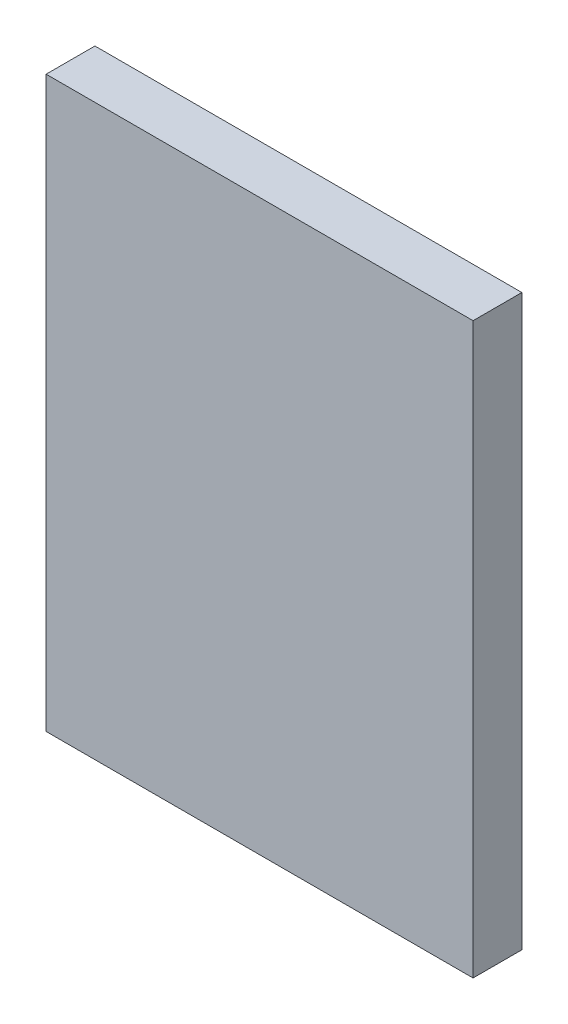
ISO-10303-21;
HEADER;
FILE_DESCRIPTION(('STEP AP214'),'2;1');
FILE_NAME('part.step','',(''),(''),'','','');
FILE_SCHEMA(('AUTOMOTIVE_DESIGN { 1 0 10303 214 1 1 1 1 }'));
ENDSEC;
DATA;
#1=APPLICATION_CONTEXT('core data for automotive mechanical design processes');
#2=APPLICATION_PROTOCOL_DEFINITION('international standard','automotive_design',2000,#1);
#3=PRODUCT_CONTEXT('',#1,'mechanical');
#4=PRODUCT('Part','Part','',(#3));
#5=PRODUCT_RELATED_PRODUCT_CATEGORY('part','',(#4));
#6=PRODUCT_DEFINITION_FORMATION('','',#4);
#7=PRODUCT_DEFINITION_CONTEXT('part definition',#1,'design');
#8=PRODUCT_DEFINITION('design','',#6,#7);
#9=PRODUCT_DEFINITION_SHAPE('','',#8);
#10=(LENGTH_UNIT() NAMED_UNIT(*) SI_UNIT(.MILLI.,.METRE.));
#11=(NAMED_UNIT(*) PLANE_ANGLE_UNIT() SI_UNIT($,.RADIAN.));
#12=(NAMED_UNIT(*) SI_UNIT($,.STERADIAN.) SOLID_ANGLE_UNIT());
#13=UNCERTAINTY_MEASURE_WITH_UNIT(LENGTH_MEASURE(1.E-05),#10,'distance_accuracy_value','');
#14=(GEOMETRIC_REPRESENTATION_CONTEXT(3) GLOBAL_UNCERTAINTY_ASSIGNED_CONTEXT((#13)) GLOBAL_UNIT_ASSIGNED_CONTEXT((#10,
#11,#12)) REPRESENTATION_CONTEXT('',''));
#15=CARTESIAN_POINT('',(0.,0.,0.));
#16=DIRECTION('',(0.,0.,1.));
#17=DIRECTION('',(1.,0.,0.));
#18=AXIS2_PLACEMENT_3D('',#15,#16,#17);
#19=CARTESIAN_POINT('',(6.828,8.801,0.76487));
#20=DIRECTION('',(0.,0.,-1.));
#21=DIRECTION('',(-1.,0.,0.));
#22=AXIS2_PLACEMENT_3D('',#19,#20,#21);
#23=PLANE('',#22);
#24=DIRECTION('',(1.,0.,0.));
#25=VECTOR('',#24,1.);
#26=CARTESIAN_POINT('',(6.678,9.001,0.76487));
#27=LINE('',#26,#25);
#28=CARTESIAN_POINT('',(6.678,9.001,0.76487));
#29=VERTEX_POINT('',#28);
#30=CARTESIAN_POINT('',(6.978,9.001,0.76487));
#31=VERTEX_POINT('',#30);
#32=EDGE_CURVE('E55',#29,#31,#27,.T.);
#33=ORIENTED_EDGE('',*,*,#32,.T.);
#34=DIRECTION('',(0.,1.,0.));
#35=VECTOR('',#34,1.);
#36=CARTESIAN_POINT('',(6.978,9.001,0.76487));
#37=LINE('',#36,#35);
#38=CARTESIAN_POINT('',(6.978,8.601,0.76487));
#39=VERTEX_POINT('',#38);
#40=EDGE_CURVE('E57',#31,#39,#37,.F.);
#41=ORIENTED_EDGE('',*,*,#40,.T.);
#42=DIRECTION('',(1.,0.,0.));
#43=VECTOR('',#42,1.);
#44=CARTESIAN_POINT('',(6.978,8.601,0.76487));
#45=LINE('',#44,#43);
#46=CARTESIAN_POINT('',(6.678,8.601,0.76487));
#47=VERTEX_POINT('',#46);
#48=EDGE_CURVE('E20',#39,#47,#45,.F.);
#49=ORIENTED_EDGE('',*,*,#48,.T.);
#50=DIRECTION('',(0.,1.,0.));
#51=VECTOR('',#50,1.);
#52=CARTESIAN_POINT('',(6.678,8.601,0.76487));
#53=LINE('',#52,#51);
#54=EDGE_CURVE('E80',#47,#29,#53,.T.);
#55=ORIENTED_EDGE('',*,*,#54,.T.);
#56=EDGE_LOOP('',(#33,#41,#49,#55));
#57=FACE_BOUND('',#56,.T.);
#58=ADVANCED_FACE('F17',(#57),#23,.T.);
#59=CARTESIAN_POINT('',(6.978,8.601,0.76487));
#60=DIRECTION('',(0.,1.,0.));
#61=DIRECTION('',(0.,0.,1.));
#62=AXIS2_PLACEMENT_3D('',#59,#60,#61);
#63=PLANE('',#62);
#64=DIRECTION('',(0.,0.,-1.));
#65=VECTOR('',#64,1.);
#66=CARTESIAN_POINT('',(6.678,8.601,0.76487));
#67=LINE('',#66,#65);
#68=CARTESIAN_POINT('',(6.678,8.601,0.79916));
#69=VERTEX_POINT('',#68);
#70=EDGE_CURVE('E68',#69,#47,#67,.T.);
#71=ORIENTED_EDGE('',*,*,#70,.T.);
#72=ORIENTED_EDGE('',*,*,#48,.F.);
#73=DIRECTION('',(0.,0.,1.));
#74=VECTOR('',#73,1.);
#75=CARTESIAN_POINT('',(6.978,8.601,0.76487));
#76=LINE('',#75,#74);
#77=CARTESIAN_POINT('',(6.978,8.601,0.79916));
#78=VERTEX_POINT('',#77);
#79=EDGE_CURVE('E63',#39,#78,#76,.T.);
#80=ORIENTED_EDGE('',*,*,#79,.T.);
#81=DIRECTION('',(1.,0.,0.));
#82=VECTOR('',#81,1.);
#83=CARTESIAN_POINT('',(6.828,8.601,0.79916));
#84=LINE('',#83,#82);
#85=EDGE_CURVE('E83',#69,#78,#84,.T.);
#86=ORIENTED_EDGE('',*,*,#85,.F.);
#87=EDGE_LOOP('',(#71,#72,#80,#86));
#88=FACE_BOUND('',#87,.T.);
#89=ADVANCED_FACE('F65',(#88),#63,.F.);
#90=CARTESIAN_POINT('',(6.978,9.001,0.76487));
#91=DIRECTION('',(-1.,0.,0.));
#92=DIRECTION('',(0.,0.,1.));
#93=AXIS2_PLACEMENT_3D('',#90,#91,#92);
#94=PLANE('',#93);
#95=ORIENTED_EDGE('',*,*,#79,.F.);
#96=ORIENTED_EDGE('',*,*,#40,.F.);
#97=DIRECTION('',(0.,0.,-1.));
#98=VECTOR('',#97,1.);
#99=CARTESIAN_POINT('',(6.978,9.001,0.76487));
#100=LINE('',#99,#98);
#101=CARTESIAN_POINT('',(6.978,9.001,0.79916));
#102=VERTEX_POINT('',#101);
#103=EDGE_CURVE('E75',#31,#102,#100,.F.);
#104=ORIENTED_EDGE('',*,*,#103,.T.);
#105=DIRECTION('',(0.,-1.,0.));
#106=VECTOR('',#105,1.);
#107=CARTESIAN_POINT('',(6.978,8.801,0.79916));
#108=LINE('',#107,#106);
#109=EDGE_CURVE('E72',#78,#102,#108,.F.);
#110=ORIENTED_EDGE('',*,*,#109,.F.);
#111=EDGE_LOOP('',(#95,#96,#104,#110));
#112=FACE_BOUND('',#111,.T.);
#113=ADVANCED_FACE('F70',(#112),#94,.F.);
#114=CARTESIAN_POINT('',(6.678,9.001,0.76487));
#115=DIRECTION('',(0.,-1.,0.));
#116=DIRECTION('',(0.,0.,-1.));
#117=AXIS2_PLACEMENT_3D('',#114,#115,#116);
#118=PLANE('',#117);
#119=ORIENTED_EDGE('',*,*,#103,.F.);
#120=ORIENTED_EDGE('',*,*,#32,.F.);
#121=DIRECTION('',(0.,0.,-1.));
#122=VECTOR('',#121,1.);
#123=CARTESIAN_POINT('',(6.678,9.001,0.76487));
#124=LINE('',#123,#122);
#125=CARTESIAN_POINT('',(6.678,9.001,0.79916));
#126=VERTEX_POINT('',#125);
#127=EDGE_CURVE('E35',#29,#126,#124,.F.);
#128=ORIENTED_EDGE('',*,*,#127,.T.);
#129=DIRECTION('',(1.,0.,0.));
#130=VECTOR('',#129,1.);
#131=CARTESIAN_POINT('',(6.828,9.001,0.79916));
#132=LINE('',#131,#130);
#133=EDGE_CURVE('E26',#102,#126,#132,.F.);
#134=ORIENTED_EDGE('',*,*,#133,.F.);
#135=EDGE_LOOP('',(#119,#120,#128,#134));
#136=FACE_BOUND('',#135,.T.);
#137=ADVANCED_FACE('F89',(#136),#118,.F.);
#138=CARTESIAN_POINT('',(6.678,8.601,0.76487));
#139=DIRECTION('',(1.,0.,0.));
#140=DIRECTION('',(0.,0.,-1.));
#141=AXIS2_PLACEMENT_3D('',#138,#139,#140);
#142=PLANE('',#141);
#143=ORIENTED_EDGE('',*,*,#127,.F.);
#144=ORIENTED_EDGE('',*,*,#54,.F.);
#145=ORIENTED_EDGE('',*,*,#70,.F.);
#146=DIRECTION('',(0.,-1.,0.));
#147=VECTOR('',#146,1.);
#148=CARTESIAN_POINT('',(6.678,8.801,0.79916));
#149=LINE('',#148,#147);
#150=EDGE_CURVE('E11',#126,#69,#149,.T.);
#151=ORIENTED_EDGE('',*,*,#150,.F.);
#152=EDGE_LOOP('',(#143,#144,#145,#151));
#153=FACE_BOUND('',#152,.T.);
#154=ADVANCED_FACE('F91',(#153),#142,.F.);
#155=CARTESIAN_POINT('',(6.828,8.801,0.79916));
#156=DIRECTION('',(0.,0.,1.));
#157=DIRECTION('',(0.,-1.,0.));
#158=AXIS2_PLACEMENT_3D('',#155,#156,#157);
#159=PLANE('',#158);
#160=ORIENTED_EDGE('',*,*,#133,.T.);
#161=ORIENTED_EDGE('',*,*,#150,.T.);
#162=ORIENTED_EDGE('',*,*,#85,.T.);
#163=ORIENTED_EDGE('',*,*,#109,.T.);
#164=EDGE_LOOP('',(#160,#161,#162,#163));
#165=FACE_BOUND('',#164,.T.);
#166=ADVANCED_FACE('F88',(#165),#159,.T.);
#167=CLOSED_SHELL('',(#58,#89,#113,#137,#154,#166));
#168=MANIFOLD_SOLID_BREP('B1',#167);
#169=ADVANCED_BREP_SHAPE_REPRESENTATION('',(#18,#168),#14);
#170=SHAPE_DEFINITION_REPRESENTATION(#9,#169);
ENDSEC;
END-ISO-10303-21;
